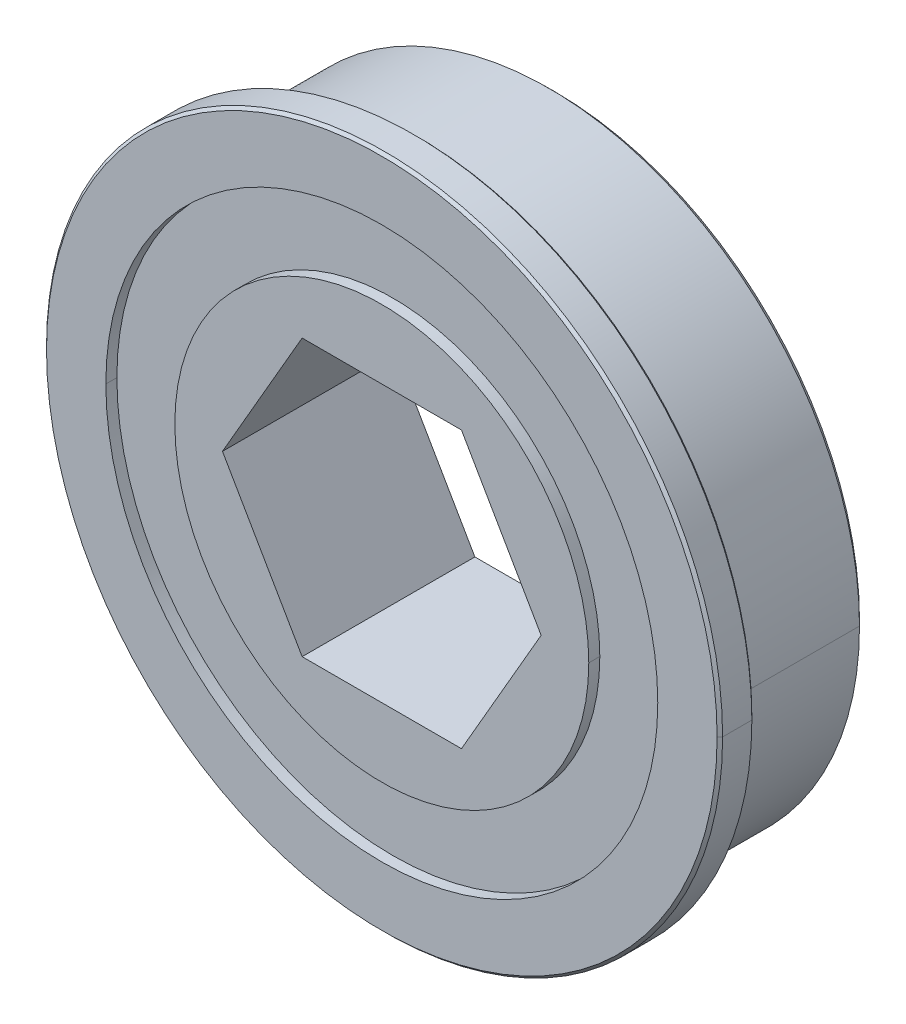
ISO-10303-21;
HEADER;
FILE_DESCRIPTION(('STEP AP214'),'2;1');
FILE_NAME('part.step','',(''),(''),'','','');
FILE_SCHEMA(('AUTOMOTIVE_DESIGN { 1 0 10303 214 1 1 1 1 }'));
ENDSEC;
DATA;
#1=APPLICATION_CONTEXT('core data for automotive mechanical design processes');
#2=APPLICATION_PROTOCOL_DEFINITION('international standard','automotive_design',2000,#1);
#3=PRODUCT_CONTEXT('',#1,'mechanical');
#4=PRODUCT('Part','Part','',(#3));
#5=PRODUCT_RELATED_PRODUCT_CATEGORY('part','',(#4));
#6=PRODUCT_DEFINITION_FORMATION('','',#4);
#7=PRODUCT_DEFINITION_CONTEXT('part definition',#1,'design');
#8=PRODUCT_DEFINITION('design','',#6,#7);
#9=PRODUCT_DEFINITION_SHAPE('','',#8);
#10=(LENGTH_UNIT() NAMED_UNIT(*) SI_UNIT(.MILLI.,.METRE.));
#11=(NAMED_UNIT(*) PLANE_ANGLE_UNIT() SI_UNIT($,.RADIAN.));
#12=(NAMED_UNIT(*) SI_UNIT($,.STERADIAN.) SOLID_ANGLE_UNIT());
#13=UNCERTAINTY_MEASURE_WITH_UNIT(LENGTH_MEASURE(1.E-05),#10,'distance_accuracy_value','');
#14=(GEOMETRIC_REPRESENTATION_CONTEXT(3) GLOBAL_UNCERTAINTY_ASSIGNED_CONTEXT((#13)) GLOBAL_UNIT_ASSIGNED_CONTEXT((#10,
#11,#12)) REPRESENTATION_CONTEXT('',''));
#15=CARTESIAN_POINT('',(0.,0.,0.));
#16=DIRECTION('',(0.,0.,1.));
#17=DIRECTION('',(1.,0.,0.));
#18=AXIS2_PLACEMENT_3D('',#15,#16,#17);
#19=CARTESIAN_POINT('',(7.33234841870825,0.,-3.975));
#20=DIRECTION('',(0.866025403784439,0.5,0.));
#21=DIRECTION('',(0.,0.,-1.));
#22=AXIS2_PLACEMENT_3D('',#19,#20,#21);
#23=PLANE('',#22);
#24=DIRECTION('',(-0.5,0.866025403784439,0.));
#25=VECTOR('',#24,1.);
#26=CARTESIAN_POINT('',(7.33234841870825,0.,3.975));
#27=LINE('',#26,#25);
#28=CARTESIAN_POINT('',(7.33234841870825,0.,3.975));
#29=VERTEX_POINT('',#28);
#30=CARTESIAN_POINT('',(3.66617420935412,6.35,3.975));
#31=VERTEX_POINT('',#30);
#32=EDGE_CURVE('E402',#29,#31,#27,.T.);
#33=ORIENTED_EDGE('',*,*,#32,.T.);
#34=DIRECTION('',(0.,0.,1.));
#35=VECTOR('',#34,1.);
#36=CARTESIAN_POINT('',(3.66617420935412,6.35,-3.975));
#37=LINE('',#36,#35);
#38=CARTESIAN_POINT('',(3.66617420935412,6.35,-3.975));
#39=VERTEX_POINT('',#38);
#40=EDGE_CURVE('E10',#39,#31,#37,.T.);
#41=ORIENTED_EDGE('',*,*,#40,.F.);
#42=DIRECTION('',(-0.5,0.866025403784439,0.));
#43=VECTOR('',#42,1.);
#44=CARTESIAN_POINT('',(7.33234841870825,0.,-3.975));
#45=LINE('',#44,#43);
#46=CARTESIAN_POINT('',(7.33234841870825,0.,-3.975));
#47=VERTEX_POINT('',#46);
#48=EDGE_CURVE('E434',#47,#39,#45,.T.);
#49=ORIENTED_EDGE('',*,*,#48,.F.);
#50=DIRECTION('',(0.,0.,1.));
#51=VECTOR('',#50,1.);
#52=CARTESIAN_POINT('',(7.33234841870825,0.,-3.975));
#53=LINE('',#52,#51);
#54=EDGE_CURVE('E354',#47,#29,#53,.T.);
#55=ORIENTED_EDGE('',*,*,#54,.T.);
#56=EDGE_LOOP('',(#33,#41,#49,#55));
#57=FACE_BOUND('',#56,.T.);
#58=ADVANCED_FACE('F16',(#57),#23,.F.);
#59=CARTESIAN_POINT('',(3.66617420935412,6.35,-3.975));
#60=DIRECTION('',(0.,1.,0.));
#61=DIRECTION('',(1.,0.,0.));
#62=AXIS2_PLACEMENT_3D('',#59,#60,#61);
#63=PLANE('',#62);
#64=DIRECTION('',(-1.,0.,0.));
#65=VECTOR('',#64,1.);
#66=CARTESIAN_POINT('',(3.66617420935412,6.35,3.975));
#67=LINE('',#66,#65);
#68=CARTESIAN_POINT('',(-3.66617420935412,6.35,3.975));
#69=VERTEX_POINT('',#68);
#70=EDGE_CURVE('E295',#31,#69,#67,.T.);
#71=ORIENTED_EDGE('',*,*,#70,.T.);
#72=DIRECTION('',(0.,0.,1.));
#73=VECTOR('',#72,1.);
#74=CARTESIAN_POINT('',(-3.66617420935412,6.35,-3.975));
#75=LINE('',#74,#73);
#76=CARTESIAN_POINT('',(-3.66617420935412,6.35,-3.975));
#77=VERTEX_POINT('',#76);
#78=EDGE_CURVE('E19',#77,#69,#75,.T.);
#79=ORIENTED_EDGE('',*,*,#78,.F.);
#80=DIRECTION('',(-1.,0.,0.));
#81=VECTOR('',#80,1.);
#82=CARTESIAN_POINT('',(3.66617420935412,6.35,-3.975));
#83=LINE('',#82,#81);
#84=EDGE_CURVE('E438',#39,#77,#83,.T.);
#85=ORIENTED_EDGE('',*,*,#84,.F.);
#86=ORIENTED_EDGE('',*,*,#40,.T.);
#87=EDGE_LOOP('',(#71,#79,#85,#86));
#88=FACE_BOUND('',#87,.T.);
#89=ADVANCED_FACE('F479',(#88),#63,.F.);
#90=CARTESIAN_POINT('',(-3.66617420935412,6.35,-3.975));
#91=DIRECTION('',(-0.866025403784439,0.5,0.));
#92=DIRECTION('',(0.,0.,1.));
#93=AXIS2_PLACEMENT_3D('',#90,#91,#92);
#94=PLANE('',#93);
#95=DIRECTION('',(-0.5,-0.866025403784439,0.));
#96=VECTOR('',#95,1.);
#97=CARTESIAN_POINT('',(-3.66617420935412,6.35,3.975));
#98=LINE('',#97,#96);
#99=CARTESIAN_POINT('',(-7.33234841870825,0.,3.975));
#100=VERTEX_POINT('',#99);
#101=EDGE_CURVE('E292',#69,#100,#98,.T.);
#102=ORIENTED_EDGE('',*,*,#101,.T.);
#103=DIRECTION('',(0.,0.,1.));
#104=VECTOR('',#103,1.);
#105=CARTESIAN_POINT('',(-7.33234841870825,0.,-3.975));
#106=LINE('',#105,#104);
#107=CARTESIAN_POINT('',(-7.33234841870825,0.,-3.975));
#108=VERTEX_POINT('',#107);
#109=EDGE_CURVE('E38',#108,#100,#106,.T.);
#110=ORIENTED_EDGE('',*,*,#109,.F.);
#111=DIRECTION('',(-0.5,-0.866025403784439,0.));
#112=VECTOR('',#111,1.);
#113=CARTESIAN_POINT('',(-3.66617420935412,6.35,-3.975));
#114=LINE('',#113,#112);
#115=EDGE_CURVE('E439',#77,#108,#114,.T.);
#116=ORIENTED_EDGE('',*,*,#115,.F.);
#117=ORIENTED_EDGE('',*,*,#78,.T.);
#118=EDGE_LOOP('',(#102,#110,#116,#117));
#119=FACE_BOUND('',#118,.T.);
#120=ADVANCED_FACE('F474',(#119),#94,.F.);
#121=CARTESIAN_POINT('',(-7.33234841870825,0.,-3.975));
#122=DIRECTION('',(-0.866025403784439,-0.5,0.));
#123=DIRECTION('',(-0.5,0.866025403784439,0.));
#124=AXIS2_PLACEMENT_3D('',#121,#122,#123);
#125=PLANE('',#124);
#126=DIRECTION('',(0.5,-0.866025403784439,0.));
#127=VECTOR('',#126,1.);
#128=CARTESIAN_POINT('',(-7.33234841870825,0.,3.975));
#129=LINE('',#128,#127);
#130=CARTESIAN_POINT('',(-3.66617420935412,-6.35,3.975));
#131=VERTEX_POINT('',#130);
#132=EDGE_CURVE('E296',#100,#131,#129,.T.);
#133=ORIENTED_EDGE('',*,*,#132,.T.);
#134=DIRECTION('',(0.,0.,1.));
#135=VECTOR('',#134,1.);
#136=CARTESIAN_POINT('',(-3.66617420935412,-6.35,-3.975));
#137=LINE('',#136,#135);
#138=CARTESIAN_POINT('',(-3.66617420935412,-6.35,-3.975));
#139=VERTEX_POINT('',#138);
#140=EDGE_CURVE('E353',#139,#131,#137,.T.);
#141=ORIENTED_EDGE('',*,*,#140,.F.);
#142=DIRECTION('',(0.5,-0.866025403784439,0.));
#143=VECTOR('',#142,1.);
#144=CARTESIAN_POINT('',(-7.33234841870825,0.,-3.975));
#145=LINE('',#144,#143);
#146=EDGE_CURVE('E309',#108,#139,#145,.T.);
#147=ORIENTED_EDGE('',*,*,#146,.F.);
#148=ORIENTED_EDGE('',*,*,#109,.T.);
#149=EDGE_LOOP('',(#133,#141,#147,#148));
#150=FACE_BOUND('',#149,.T.);
#151=ADVANCED_FACE('F487',(#150),#125,.F.);
#152=CARTESIAN_POINT('',(-3.66617420935412,-6.35,-3.975));
#153=DIRECTION('',(0.,-1.,0.));
#154=DIRECTION('',(0.,0.,-1.));
#155=AXIS2_PLACEMENT_3D('',#152,#153,#154);
#156=PLANE('',#155);
#157=DIRECTION('',(1.,0.,0.));
#158=VECTOR('',#157,1.);
#159=CARTESIAN_POINT('',(-3.66617420935412,-6.35,3.975));
#160=LINE('',#159,#158);
#161=CARTESIAN_POINT('',(3.66617420935412,-6.35,3.975));
#162=VERTEX_POINT('',#161);
#163=EDGE_CURVE('E407',#131,#162,#160,.T.);
#164=ORIENTED_EDGE('',*,*,#163,.T.);
#165=DIRECTION('',(0.,0.,1.));
#166=VECTOR('',#165,1.);
#167=CARTESIAN_POINT('',(3.66617420935412,-6.35,-3.975));
#168=LINE('',#167,#166);
#169=CARTESIAN_POINT('',(3.66617420935412,-6.35,-3.975));
#170=VERTEX_POINT('',#169);
#171=EDGE_CURVE('E350',#170,#162,#168,.T.);
#172=ORIENTED_EDGE('',*,*,#171,.F.);
#173=DIRECTION('',(1.,0.,0.));
#174=VECTOR('',#173,1.);
#175=CARTESIAN_POINT('',(-3.66617420935412,-6.35,-3.975));
#176=LINE('',#175,#174);
#177=EDGE_CURVE('E422',#139,#170,#176,.T.);
#178=ORIENTED_EDGE('',*,*,#177,.F.);
#179=ORIENTED_EDGE('',*,*,#140,.T.);
#180=EDGE_LOOP('',(#164,#172,#178,#179));
#181=FACE_BOUND('',#180,.T.);
#182=ADVANCED_FACE('F493',(#181),#156,.F.);
#183=CARTESIAN_POINT('',(3.66617420935412,-6.35,-3.975));
#184=DIRECTION('',(0.866025403784439,-0.5,0.));
#185=DIRECTION('',(0.,0.,-1.));
#186=AXIS2_PLACEMENT_3D('',#183,#184,#185);
#187=PLANE('',#186);
#188=DIRECTION('',(0.5,0.866025403784439,0.));
#189=VECTOR('',#188,1.);
#190=CARTESIAN_POINT('',(3.66617420935412,-6.35,3.975));
#191=LINE('',#190,#189);
#192=EDGE_CURVE('E403',#162,#29,#191,.T.);
#193=ORIENTED_EDGE('',*,*,#192,.T.);
#194=ORIENTED_EDGE('',*,*,#54,.F.);
#195=DIRECTION('',(0.5,0.866025403784439,0.));
#196=VECTOR('',#195,1.);
#197=CARTESIAN_POINT('',(3.66617420935412,-6.35,-3.975));
#198=LINE('',#197,#196);
#199=EDGE_CURVE('E426',#170,#47,#198,.T.);
#200=ORIENTED_EDGE('',*,*,#199,.F.);
#201=ORIENTED_EDGE('',*,*,#171,.T.);
#202=EDGE_LOOP('',(#193,#194,#200,#201));
#203=FACE_BOUND('',#202,.T.);
#204=ADVANCED_FACE('F496',(#203),#187,.F.);
#205=CARTESIAN_POINT('',(0.,0.,3.975));
#206=DIRECTION('',(0.,0.,-1.));
#207=DIRECTION('',(-1.,0.,0.));
#208=AXIS2_PLACEMENT_3D('',#205,#206,#207);
#209=CONICAL_SURFACE('',#208,15.4305,0.785398163397469);
#210=DIRECTION('',(0.707106781186562,0.,-0.707106781186533));
#211=VECTOR('',#210,1.);
#212=CARTESIAN_POINT('',(15.4305,0.,3.975));
#213=LINE('',#212,#211);
#214=CARTESIAN_POINT('',(15.4305,0.,3.975));
#215=VERTEX_POINT('',#214);
#216=CARTESIAN_POINT('',(15.5575,0.,3.848));
#217=VERTEX_POINT('',#216);
#218=EDGE_CURVE('E509',#215,#217,#213,.T.);
#219=ORIENTED_EDGE('',*,*,#218,.F.);
#220=CARTESIAN_POINT('',(0.,0.,3.975));
#221=DIRECTION('',(0.,0.,1.));
#222=DIRECTION('',(-1.,0.,0.));
#223=AXIS2_PLACEMENT_3D('',#220,#221,#222);
#224=CIRCLE('',#223,15.4305);
#225=CARTESIAN_POINT('',(-15.4305,0.,3.975));
#226=VERTEX_POINT('',#225);
#227=EDGE_CURVE('E448',#226,#215,#224,.T.);
#228=ORIENTED_EDGE('',*,*,#227,.F.);
#229=DIRECTION('',(-0.707106781186562,0.,-0.707106781186533));
#230=VECTOR('',#229,1.);
#231=CARTESIAN_POINT('',(-15.4305,0.,3.975));
#232=LINE('',#231,#230);
#233=CARTESIAN_POINT('',(-15.5575,0.,3.848));
#234=VERTEX_POINT('',#233);
#235=EDGE_CURVE('E250',#226,#234,#232,.T.);
#236=ORIENTED_EDGE('',*,*,#235,.T.);
#237=CARTESIAN_POINT('',(0.,0.,3.848));
#238=DIRECTION('',(0.,0.,-1.));
#239=DIRECTION('',(-1.,0.,0.));
#240=AXIS2_PLACEMENT_3D('',#237,#238,#239);
#241=CIRCLE('',#240,15.5575);
#242=EDGE_CURVE('E308',#217,#234,#241,.T.);
#243=ORIENTED_EDGE('',*,*,#242,.F.);
#244=EDGE_LOOP('',(#219,#228,#236,#243));
#245=FACE_BOUND('',#244,.T.);
#246=ADVANCED_FACE('F562',(#245),#209,.T.);
#247=CARTESIAN_POINT('',(0.,0.,2.502));
#248=DIRECTION('',(0.,0.,1.));
#249=DIRECTION('',(1.,0.,0.));
#250=AXIS2_PLACEMENT_3D('',#247,#248,#249);
#251=CONICAL_SURFACE('',#250,15.5575,0.785398163397442);
#252=DIRECTION('',(-0.707106781186543,0.,0.707106781186552));
#253=VECTOR('',#252,1.);
#254=CARTESIAN_POINT('',(-15.5575,0.,2.502));
#255=LINE('',#254,#253);
#256=CARTESIAN_POINT('',(-15.4305,0.,2.375));
#257=VERTEX_POINT('',#256);
#258=CARTESIAN_POINT('',(-15.5575,0.,2.502));
#259=VERTEX_POINT('',#258);
#260=EDGE_CURVE('E232',#257,#259,#255,.T.);
#261=ORIENTED_EDGE('',*,*,#260,.F.);
#262=CARTESIAN_POINT('',(0.,0.,2.375));
#263=DIRECTION('',(0.,0.,-1.));
#264=DIRECTION('',(1.,0.,0.));
#265=AXIS2_PLACEMENT_3D('',#262,#263,#264);
#266=CIRCLE('',#265,15.4305);
#267=CARTESIAN_POINT('',(15.4305,0.,2.375));
#268=VERTEX_POINT('',#267);
#269=EDGE_CURVE('E226',#268,#257,#266,.T.);
#270=ORIENTED_EDGE('',*,*,#269,.F.);
#271=DIRECTION('',(0.707106781186543,0.,0.707106781186552));
#272=VECTOR('',#271,1.);
#273=CARTESIAN_POINT('',(15.5575,0.,2.502));
#274=LINE('',#273,#272);
#275=CARTESIAN_POINT('',(15.5575,0.,2.502));
#276=VERTEX_POINT('',#275);
#277=EDGE_CURVE('E229',#268,#276,#274,.T.);
#278=ORIENTED_EDGE('',*,*,#277,.T.);
#279=CARTESIAN_POINT('',(0.,0.,2.502));
#280=DIRECTION('',(0.,0.,1.));
#281=DIRECTION('',(1.,0.,0.));
#282=AXIS2_PLACEMENT_3D('',#279,#280,#281);
#283=CIRCLE('',#282,15.5575);
#284=EDGE_CURVE('E305',#259,#276,#283,.T.);
#285=ORIENTED_EDGE('',*,*,#284,.F.);
#286=EDGE_LOOP('',(#261,#270,#278,#285));
#287=FACE_BOUND('',#286,.T.);
#288=ADVANCED_FACE('F228',(#287),#251,.T.);
#289=CARTESIAN_POINT('',(0.,0.,-3.721));
#290=DIRECTION('',(0.,0.,1.));
#291=DIRECTION('',(1.,0.,0.));
#292=AXIS2_PLACEMENT_3D('',#289,#290,#291);
#293=CONICAL_SURFACE('',#292,14.2875,0.785398163397445);
#294=DIRECTION('',(-0.707106781186545,0.,0.70710678118655));
#295=VECTOR('',#294,1.);
#296=CARTESIAN_POINT('',(-14.2875,0.,-3.721));
#297=LINE('',#296,#295);
#298=CARTESIAN_POINT('',(-14.0335,0.,-3.975));
#299=VERTEX_POINT('',#298);
#300=CARTESIAN_POINT('',(-14.2875,0.,-3.721));
#301=VERTEX_POINT('',#300);
#302=EDGE_CURVE('E272',#299,#301,#297,.T.);
#303=ORIENTED_EDGE('',*,*,#302,.F.);
#304=CARTESIAN_POINT('',(0.,0.,-3.975));
#305=DIRECTION('',(0.,0.,-1.));
#306=DIRECTION('',(1.,0.,0.));
#307=AXIS2_PLACEMENT_3D('',#304,#305,#306);
#308=CIRCLE('',#307,14.0335);
#309=CARTESIAN_POINT('',(14.0335,0.,-3.975));
#310=VERTEX_POINT('',#309);
#311=EDGE_CURVE('E281',#310,#299,#308,.T.);
#312=ORIENTED_EDGE('',*,*,#311,.F.);
#313=DIRECTION('',(0.707106781186545,0.,0.70710678118655));
#314=VECTOR('',#313,1.);
#315=CARTESIAN_POINT('',(14.2875,0.,-3.721));
#316=LINE('',#315,#314);
#317=CARTESIAN_POINT('',(14.2875,0.,-3.721));
#318=VERTEX_POINT('',#317);
#319=EDGE_CURVE('E297',#310,#318,#316,.T.);
#320=ORIENTED_EDGE('',*,*,#319,.T.);
#321=CARTESIAN_POINT('',(0.,0.,-3.721));
#322=DIRECTION('',(0.,0.,1.));
#323=DIRECTION('',(1.,0.,0.));
#324=AXIS2_PLACEMENT_3D('',#321,#322,#323);
#325=CIRCLE('',#324,14.2875);
#326=EDGE_CURVE('E280',#301,#318,#325,.T.);
#327=ORIENTED_EDGE('',*,*,#326,.F.);
#328=EDGE_LOOP('',(#303,#312,#320,#327));
#329=FACE_BOUND('',#328,.T.);
#330=ADVANCED_FACE('F561',(#329),#293,.T.);
#331=CARTESIAN_POINT('',(0.,0.,3.467));
#332=DIRECTION('',(0.,0.,1.));
#333=DIRECTION('',(1.,0.,0.));
#334=AXIS2_PLACEMENT_3D('',#331,#332,#333);
#335=CYLINDRICAL_SURFACE('',#334,9.525);
#336=DIRECTION('',(0.,0.,1.));
#337=VECTOR('',#336,1.);
#338=CARTESIAN_POINT('',(-9.525,0.,3.467));
#339=LINE('',#338,#337);
#340=CARTESIAN_POINT('',(-9.525,0.,3.467));
#341=VERTEX_POINT('',#340);
#342=CARTESIAN_POINT('',(-9.525,0.,3.975));
#343=VERTEX_POINT('',#342);
#344=EDGE_CURVE('E291',#341,#343,#339,.T.);
#345=ORIENTED_EDGE('',*,*,#344,.F.);
#346=CARTESIAN_POINT('',(0.,0.,3.467));
#347=DIRECTION('',(0.,0.,-1.));
#348=DIRECTION('',(-1.,0.,0.));
#349=AXIS2_PLACEMENT_3D('',#346,#347,#348);
#350=CIRCLE('',#349,9.525);
#351=CARTESIAN_POINT('',(9.525,0.,3.467));
#352=VERTEX_POINT('',#351);
#353=EDGE_CURVE('E416',#352,#341,#350,.T.);
#354=ORIENTED_EDGE('',*,*,#353,.F.);
#355=DIRECTION('',(0.,0.,1.));
#356=VECTOR('',#355,1.);
#357=CARTESIAN_POINT('',(9.525,0.,3.467));
#358=LINE('',#357,#356);
#359=CARTESIAN_POINT('',(9.525,0.,3.975));
#360=VERTEX_POINT('',#359);
#361=EDGE_CURVE('E282',#352,#360,#358,.T.);
#362=ORIENTED_EDGE('',*,*,#361,.T.);
#363=CARTESIAN_POINT('',(0.,0.,3.975));
#364=DIRECTION('',(0.,0.,-1.));
#365=DIRECTION('',(-1.,0.,0.));
#366=AXIS2_PLACEMENT_3D('',#363,#364,#365);
#367=CIRCLE('',#366,9.525);
#368=EDGE_CURVE('E380',#360,#343,#367,.T.);
#369=ORIENTED_EDGE('',*,*,#368,.T.);
#370=EDGE_LOOP('',(#345,#354,#362,#369));
#371=FACE_BOUND('',#370,.T.);
#372=ADVANCED_FACE('F530',(#371),#335,.T.);
#373=CARTESIAN_POINT('',(0.,0.,3.467));
#374=DIRECTION('',(0.,0.,1.));
#375=DIRECTION('',(1.,0.,0.));
#376=AXIS2_PLACEMENT_3D('',#373,#374,#375);
#377=CYLINDRICAL_SURFACE('',#376,12.7);
#378=DIRECTION('',(0.,0.,1.));
#379=VECTOR('',#378,1.);
#380=CARTESIAN_POINT('',(-12.7,0.,3.467));
#381=LINE('',#380,#379);
#382=CARTESIAN_POINT('',(-12.7,0.,3.467));
#383=VERTEX_POINT('',#382);
#384=CARTESIAN_POINT('',(-12.7,0.,3.975));
#385=VERTEX_POINT('',#384);
#386=EDGE_CURVE('E313',#383,#385,#381,.T.);
#387=ORIENTED_EDGE('',*,*,#386,.F.);
#388=CARTESIAN_POINT('',(0.,0.,3.467));
#389=DIRECTION('',(0.,0.,-1.));
#390=DIRECTION('',(-1.,0.,0.));
#391=AXIS2_PLACEMENT_3D('',#388,#389,#390);
#392=CIRCLE('',#391,12.7);
#393=CARTESIAN_POINT('',(12.7,0.,3.467));
#394=VERTEX_POINT('',#393);
#395=EDGE_CURVE('E430',#383,#394,#392,.T.);
#396=ORIENTED_EDGE('',*,*,#395,.T.);
#397=DIRECTION('',(0.,0.,1.));
#398=VECTOR('',#397,1.);
#399=CARTESIAN_POINT('',(12.7,0.,3.467));
#400=LINE('',#399,#398);
#401=CARTESIAN_POINT('',(12.7,0.,3.975));
#402=VERTEX_POINT('',#401);
#403=EDGE_CURVE('E324',#394,#402,#400,.T.);
#404=ORIENTED_EDGE('',*,*,#403,.T.);
#405=CARTESIAN_POINT('',(0.,0.,3.975));
#406=DIRECTION('',(0.,0.,-1.));
#407=DIRECTION('',(-1.,0.,0.));
#408=AXIS2_PLACEMENT_3D('',#405,#406,#407);
#409=CIRCLE('',#408,12.7);
#410=EDGE_CURVE('E316',#385,#402,#409,.T.);
#411=ORIENTED_EDGE('',*,*,#410,.F.);
#412=EDGE_LOOP('',(#387,#396,#404,#411));
#413=FACE_BOUND('',#412,.T.);
#414=ADVANCED_FACE('F568',(#413),#377,.F.);
#415=CARTESIAN_POINT('',(0.,0.,3.467));
#416=DIRECTION('',(0.,0.,1.));
#417=DIRECTION('',(1.,0.,0.));
#418=AXIS2_PLACEMENT_3D('',#415,#416,#417);
#419=PLANE('',#418);
#420=ORIENTED_EDGE('',*,*,#353,.T.);
#421=CARTESIAN_POINT('',(0.,0.,3.467));
#422=DIRECTION('',(0.,0.,-1.));
#423=DIRECTION('',(-1.,0.,0.));
#424=AXIS2_PLACEMENT_3D('',#421,#422,#423);
#425=CIRCLE('',#424,9.525);
#426=EDGE_CURVE('E301',#341,#352,#425,.T.);
#427=ORIENTED_EDGE('',*,*,#426,.T.);
#428=EDGE_LOOP('',(#420,#427));
#429=FACE_BOUND('',#428,.T.);
#430=CARTESIAN_POINT('',(0.,0.,3.467));
#431=DIRECTION('',(0.,0.,-1.));
#432=DIRECTION('',(-1.,0.,0.));
#433=AXIS2_PLACEMENT_3D('',#430,#431,#432);
#434=CIRCLE('',#433,12.7);
#435=EDGE_CURVE('E286',#394,#383,#434,.T.);
#436=ORIENTED_EDGE('',*,*,#435,.F.);
#437=ORIENTED_EDGE('',*,*,#395,.F.);
#438=EDGE_LOOP('',(#436,#437));
#439=FACE_BOUND('',#438,.T.);
#440=ADVANCED_FACE('F522',(#429,#439),#419,.T.);
#441=CARTESIAN_POINT('',(0.,0.,-3.467));
#442=DIRECTION('',(0.,0.,-1.));
#443=DIRECTION('',(-1.,0.,0.));
#444=AXIS2_PLACEMENT_3D('',#441,#442,#443);
#445=CYLINDRICAL_SURFACE('',#444,9.525);
#446=DIRECTION('',(0.,0.,-1.));
#447=VECTOR('',#446,1.);
#448=CARTESIAN_POINT('',(9.525,0.,-3.467));
#449=LINE('',#448,#447);
#450=CARTESIAN_POINT('',(9.525,0.,-3.467));
#451=VERTEX_POINT('',#450);
#452=CARTESIAN_POINT('',(9.525,0.,-3.975));
#453=VERTEX_POINT('',#452);
#454=EDGE_CURVE('E337',#451,#453,#449,.T.);
#455=ORIENTED_EDGE('',*,*,#454,.F.);
#456=CARTESIAN_POINT('',(0.,0.,-3.467));
#457=DIRECTION('',(0.,0.,-1.));
#458=DIRECTION('',(-1.,0.,0.));
#459=AXIS2_PLACEMENT_3D('',#456,#457,#458);
#460=CIRCLE('',#459,9.525);
#461=CARTESIAN_POINT('',(-9.525,0.,-3.467));
#462=VERTEX_POINT('',#461);
#463=EDGE_CURVE('E427',#451,#462,#460,.T.);
#464=ORIENTED_EDGE('',*,*,#463,.T.);
#465=DIRECTION('',(0.,0.,-1.));
#466=VECTOR('',#465,1.);
#467=CARTESIAN_POINT('',(-9.525,0.,-3.467));
#468=LINE('',#467,#466);
#469=CARTESIAN_POINT('',(-9.525,0.,-3.975));
#470=VERTEX_POINT('',#469);
#471=EDGE_CURVE('E349',#462,#470,#468,.T.);
#472=ORIENTED_EDGE('',*,*,#471,.T.);
#473=CARTESIAN_POINT('',(0.,0.,-3.975));
#474=DIRECTION('',(0.,0.,-1.));
#475=DIRECTION('',(-1.,0.,0.));
#476=AXIS2_PLACEMENT_3D('',#473,#474,#475);
#477=CIRCLE('',#476,9.525);
#478=EDGE_CURVE('E419',#453,#470,#477,.T.);
#479=ORIENTED_EDGE('',*,*,#478,.F.);
#480=EDGE_LOOP('',(#455,#464,#472,#479));
#481=FACE_BOUND('',#480,.T.);
#482=ADVANCED_FACE('F574',(#481),#445,.T.);
#483=CARTESIAN_POINT('',(0.,0.,-3.467));
#484=DIRECTION('',(0.,0.,-1.));
#485=DIRECTION('',(0.,-1.,0.));
#486=AXIS2_PLACEMENT_3D('',#483,#484,#485);
#487=PLANE('',#486);
#488=CARTESIAN_POINT('',(0.,0.,-3.467));
#489=DIRECTION('',(0.,0.,-1.));
#490=DIRECTION('',(-1.,0.,0.));
#491=AXIS2_PLACEMENT_3D('',#488,#489,#490);
#492=CIRCLE('',#491,9.525);
#493=EDGE_CURVE('E328',#462,#451,#492,.T.);
#494=ORIENTED_EDGE('',*,*,#493,.F.);
#495=ORIENTED_EDGE('',*,*,#463,.F.);
#496=EDGE_LOOP('',(#494,#495));
#497=FACE_BOUND('',#496,.T.);
#498=CARTESIAN_POINT('',(0.,0.,-3.467));
#499=DIRECTION('',(0.,0.,-1.));
#500=DIRECTION('',(-1.,0.,0.));
#501=AXIS2_PLACEMENT_3D('',#498,#499,#500);
#502=CIRCLE('',#501,12.7);
#503=CARTESIAN_POINT('',(-12.7,0.,-3.467));
#504=VERTEX_POINT('',#503);
#505=CARTESIAN_POINT('',(12.7,0.,-3.467));
#506=VERTEX_POINT('',#505);
#507=EDGE_CURVE('E237',#504,#506,#502,.T.);
#508=ORIENTED_EDGE('',*,*,#507,.T.);
#509=CARTESIAN_POINT('',(0.,0.,-3.467));
#510=DIRECTION('',(0.,0.,-1.));
#511=DIRECTION('',(-1.,0.,0.));
#512=AXIS2_PLACEMENT_3D('',#509,#510,#511);
#513=CIRCLE('',#512,12.7);
#514=EDGE_CURVE('E358',#506,#504,#513,.T.);
#515=ORIENTED_EDGE('',*,*,#514,.T.);
#516=EDGE_LOOP('',(#508,#515));
#517=FACE_BOUND('',#516,.T.);
#518=ADVANCED_FACE('F577',(#497,#517),#487,.T.);
#519=CARTESIAN_POINT('',(0.,0.,-3.467));
#520=DIRECTION('',(0.,0.,-1.));
#521=DIRECTION('',(-1.,0.,0.));
#522=AXIS2_PLACEMENT_3D('',#519,#520,#521);
#523=CYLINDRICAL_SURFACE('',#522,12.7);
#524=DIRECTION('',(0.,0.,-1.));
#525=VECTOR('',#524,1.);
#526=CARTESIAN_POINT('',(12.7,0.,-3.467));
#527=LINE('',#526,#525);
#528=CARTESIAN_POINT('',(12.7,0.,-3.975));
#529=VERTEX_POINT('',#528);
#530=EDGE_CURVE('E362',#506,#529,#527,.T.);
#531=ORIENTED_EDGE('',*,*,#530,.F.);
#532=ORIENTED_EDGE('',*,*,#507,.F.);
#533=DIRECTION('',(0.,0.,-1.));
#534=VECTOR('',#533,1.);
#535=CARTESIAN_POINT('',(-12.7,0.,-3.467));
#536=LINE('',#535,#534);
#537=CARTESIAN_POINT('',(-12.7,0.,-3.975));
#538=VERTEX_POINT('',#537);
#539=EDGE_CURVE('E262',#504,#538,#536,.T.);
#540=ORIENTED_EDGE('',*,*,#539,.T.);
#541=CARTESIAN_POINT('',(0.,0.,-3.975));
#542=DIRECTION('',(0.,0.,-1.));
#543=DIRECTION('',(-1.,0.,0.));
#544=AXIS2_PLACEMENT_3D('',#541,#542,#543);
#545=CIRCLE('',#544,12.7);
#546=EDGE_CURVE('E277',#538,#529,#545,.T.);
#547=ORIENTED_EDGE('',*,*,#546,.T.);
#548=EDGE_LOOP('',(#531,#532,#540,#547));
#549=FACE_BOUND('',#548,.T.);
#550=ADVANCED_FACE('F581',(#549),#523,.F.);
#551=CARTESIAN_POINT('',(0.,14.2875,2.375));
#552=DIRECTION('',(0.,0.,1.));
#553=DIRECTION('',(1.,0.,0.));
#554=AXIS2_PLACEMENT_3D('',#551,#552,#553);
#555=PLANE('',#554);
#556=CARTESIAN_POINT('',(0.,0.,2.375));
#557=DIRECTION('',(0.,0.,1.));
#558=DIRECTION('',(1.,0.,0.));
#559=AXIS2_PLACEMENT_3D('',#556,#557,#558);
#560=CIRCLE('',#559,14.1605);
#561=CARTESIAN_POINT('',(14.1605,0.,2.375));
#562=VERTEX_POINT('',#561);
#563=CARTESIAN_POINT('',(-14.1605,0.,2.375));
#564=VERTEX_POINT('',#563);
#565=EDGE_CURVE('E333',#562,#564,#560,.T.);
#566=ORIENTED_EDGE('',*,*,#565,.T.);
#567=CARTESIAN_POINT('',(0.,0.,2.375));
#568=DIRECTION('',(0.,0.,1.));
#569=DIRECTION('',(1.,0.,0.));
#570=AXIS2_PLACEMENT_3D('',#567,#568,#569);
#571=CIRCLE('',#570,14.1605);
#572=EDGE_CURVE('E238',#564,#562,#571,.T.);
#573=ORIENTED_EDGE('',*,*,#572,.T.);
#574=EDGE_LOOP('',(#566,#573));
#575=FACE_BOUND('',#574,.T.);
#576=ORIENTED_EDGE('',*,*,#269,.T.);
#577=CARTESIAN_POINT('',(0.,0.,2.375));
#578=DIRECTION('',(0.,0.,-1.));
#579=DIRECTION('',(1.,0.,0.));
#580=AXIS2_PLACEMENT_3D('',#577,#578,#579);
#581=CIRCLE('',#580,15.4305);
#582=EDGE_CURVE('E242',#257,#268,#581,.T.);
#583=ORIENTED_EDGE('',*,*,#582,.T.);
#584=EDGE_LOOP('',(#576,#583));
#585=FACE_BOUND('',#584,.T.);
#586=ADVANCED_FACE('F248',(#575,#585),#555,.F.);
#587=CARTESIAN_POINT('',(0.,0.,6.18055555555556));
#588=DIRECTION('',(0.,0.,1.));
#589=DIRECTION('',(1.,0.,0.));
#590=AXIS2_PLACEMENT_3D('',#587,#588,#589);
#591=CYLINDRICAL_SURFACE('',#590,14.1605);
#592=DIRECTION('',(0.,0.,1.));
#593=VECTOR('',#592,1.);
#594=CARTESIAN_POINT('',(-14.1605,0.,6.18055555555556));
#595=LINE('',#594,#593);
#596=CARTESIAN_POINT('',(-14.1605,0.,2.121));
#597=VERTEX_POINT('',#596);
#598=EDGE_CURVE('E329',#597,#564,#595,.T.);
#599=ORIENTED_EDGE('',*,*,#598,.F.);
#600=CARTESIAN_POINT('',(0.,0.,2.121));
#601=DIRECTION('',(0.,0.,1.));
#602=DIRECTION('',(1.,0.,0.));
#603=AXIS2_PLACEMENT_3D('',#600,#601,#602);
#604=CIRCLE('',#603,14.1605);
#605=CARTESIAN_POINT('',(14.1605,0.,2.121));
#606=VERTEX_POINT('',#605);
#607=EDGE_CURVE('E338',#597,#606,#604,.T.);
#608=ORIENTED_EDGE('',*,*,#607,.T.);
#609=DIRECTION('',(0.,0.,1.));
#610=VECTOR('',#609,1.);
#611=CARTESIAN_POINT('',(14.1605,0.,6.18055555555556));
#612=LINE('',#611,#610);
#613=EDGE_CURVE('E375',#606,#562,#612,.T.);
#614=ORIENTED_EDGE('',*,*,#613,.T.);
#615=ORIENTED_EDGE('',*,*,#572,.F.);
#616=EDGE_LOOP('',(#599,#608,#614,#615));
#617=FACE_BOUND('',#616,.T.);
#618=ADVANCED_FACE('F588',(#617),#591,.T.);
#619=CARTESIAN_POINT('',(0.,14.1605,2.121));
#620=DIRECTION('',(0.,0.,-1.));
#621=DIRECTION('',(0.,-1.,0.));
#622=AXIS2_PLACEMENT_3D('',#619,#620,#621);
#623=PLANE('',#622);
#624=CARTESIAN_POINT('',(0.,0.,2.121));
#625=DIRECTION('',(0.,0.,1.));
#626=DIRECTION('',(1.,0.,0.));
#627=AXIS2_PLACEMENT_3D('',#624,#625,#626);
#628=CIRCLE('',#627,14.1605);
#629=EDGE_CURVE('E265',#606,#597,#628,.T.);
#630=ORIENTED_EDGE('',*,*,#629,.F.);
#631=ORIENTED_EDGE('',*,*,#607,.F.);
#632=EDGE_LOOP('',(#630,#631));
#633=FACE_BOUND('',#632,.T.);
#634=CARTESIAN_POINT('',(0.,0.,2.121));
#635=DIRECTION('',(0.,0.,1.));
#636=DIRECTION('',(1.,0.,0.));
#637=AXIS2_PLACEMENT_3D('',#634,#635,#636);
#638=CIRCLE('',#637,14.2875);
#639=CARTESIAN_POINT('',(14.2875,0.,2.121));
#640=VERTEX_POINT('',#639);
#641=CARTESIAN_POINT('',(-14.2875,0.,2.121));
#642=VERTEX_POINT('',#641);
#643=EDGE_CURVE('E389',#640,#642,#638,.T.);
#644=ORIENTED_EDGE('',*,*,#643,.T.);
#645=CARTESIAN_POINT('',(0.,0.,2.121));
#646=DIRECTION('',(0.,0.,1.));
#647=DIRECTION('',(1.,0.,0.));
#648=AXIS2_PLACEMENT_3D('',#645,#646,#647);
#649=CIRCLE('',#648,14.2875);
#650=EDGE_CURVE('E341',#642,#640,#649,.T.);
#651=ORIENTED_EDGE('',*,*,#650,.T.);
#652=EDGE_LOOP('',(#644,#651));
#653=FACE_BOUND('',#652,.T.);
#654=ADVANCED_FACE('F592',(#633,#653),#623,.F.);
#655=CARTESIAN_POINT('',(0.,0.,6.18055555555556));
#656=DIRECTION('',(0.,0.,1.));
#657=DIRECTION('',(1.,0.,0.));
#658=AXIS2_PLACEMENT_3D('',#655,#656,#657);
#659=CYLINDRICAL_SURFACE('',#658,14.2875);
#660=DIRECTION('',(0.,0.,1.));
#661=VECTOR('',#660,1.);
#662=CARTESIAN_POINT('',(-14.2875,0.,6.18055555555556));
#663=LINE('',#662,#661);
#664=EDGE_CURVE('E385',#301,#642,#663,.T.);
#665=ORIENTED_EDGE('',*,*,#664,.F.);
#666=ORIENTED_EDGE('',*,*,#326,.T.);
#667=DIRECTION('',(0.,0.,1.));
#668=VECTOR('',#667,1.);
#669=CARTESIAN_POINT('',(14.2875,0.,6.18055555555556));
#670=LINE('',#669,#668);
#671=EDGE_CURVE('E393',#318,#640,#670,.T.);
#672=ORIENTED_EDGE('',*,*,#671,.T.);
#673=ORIENTED_EDGE('',*,*,#650,.F.);
#674=EDGE_LOOP('',(#665,#666,#672,#673));
#675=FACE_BOUND('',#674,.T.);
#676=ADVANCED_FACE('F596',(#675),#659,.T.);
#677=CARTESIAN_POINT('',(0.,5.08,-3.975));
#678=DIRECTION('',(0.,0.,1.));
#679=DIRECTION('',(1.,0.,0.));
#680=AXIS2_PLACEMENT_3D('',#677,#678,#679);
#681=PLANE('',#680);
#682=ORIENTED_EDGE('',*,*,#546,.F.);
#683=CARTESIAN_POINT('',(0.,0.,-3.975));
#684=DIRECTION('',(0.,0.,-1.));
#685=DIRECTION('',(-1.,0.,0.));
#686=AXIS2_PLACEMENT_3D('',#683,#684,#685);
#687=CIRCLE('',#686,12.7);
#688=EDGE_CURVE('E266',#529,#538,#687,.T.);
#689=ORIENTED_EDGE('',*,*,#688,.F.);
#690=EDGE_LOOP('',(#682,#689));
#691=FACE_BOUND('',#690,.T.);
#692=ORIENTED_EDGE('',*,*,#311,.T.);
#693=CARTESIAN_POINT('',(0.,0.,-3.975));
#694=DIRECTION('',(0.,0.,-1.));
#695=DIRECTION('',(1.,0.,0.));
#696=AXIS2_PLACEMENT_3D('',#693,#694,#695);
#697=CIRCLE('',#696,14.0335);
#698=EDGE_CURVE('E246',#299,#310,#697,.T.);
#699=ORIENTED_EDGE('',*,*,#698,.T.);
#700=EDGE_LOOP('',(#692,#699));
#701=FACE_BOUND('',#700,.T.);
#702=ADVANCED_FACE('F600',(#691,#701),#681,.F.);
#703=CARTESIAN_POINT('',(0.,15.5575,3.975));
#704=DIRECTION('',(0.,0.,-1.));
#705=DIRECTION('',(0.,-1.,0.));
#706=AXIS2_PLACEMENT_3D('',#703,#704,#705);
#707=PLANE('',#706);
#708=CARTESIAN_POINT('',(0.,0.,3.975));
#709=DIRECTION('',(0.,0.,-1.));
#710=DIRECTION('',(-1.,0.,0.));
#711=AXIS2_PLACEMENT_3D('',#708,#709,#710);
#712=CIRCLE('',#711,12.7);
#713=EDGE_CURVE('E320',#402,#385,#712,.T.);
#714=ORIENTED_EDGE('',*,*,#713,.T.);
#715=ORIENTED_EDGE('',*,*,#410,.T.);
#716=EDGE_LOOP('',(#714,#715));
#717=FACE_BOUND('',#716,.T.);
#718=ORIENTED_EDGE('',*,*,#227,.T.);
#719=CARTESIAN_POINT('',(0.,0.,3.975));
#720=DIRECTION('',(0.,0.,1.));
#721=DIRECTION('',(-1.,0.,0.));
#722=AXIS2_PLACEMENT_3D('',#719,#720,#721);
#723=CIRCLE('',#722,15.4305);
#724=EDGE_CURVE('E513',#215,#226,#723,.T.);
#725=ORIENTED_EDGE('',*,*,#724,.T.);
#726=EDGE_LOOP('',(#718,#725));
#727=FACE_BOUND('',#726,.T.);
#728=ADVANCED_FACE('F605',(#717,#727),#707,.F.);
#729=CARTESIAN_POINT('',(0.,0.,6.18055555555556));
#730=DIRECTION('',(0.,0.,1.));
#731=DIRECTION('',(1.,0.,0.));
#732=AXIS2_PLACEMENT_3D('',#729,#730,#731);
#733=CYLINDRICAL_SURFACE('',#732,15.5575);
#734=DIRECTION('',(0.,0.,1.));
#735=VECTOR('',#734,1.);
#736=CARTESIAN_POINT('',(-15.5575,0.,6.18055555555556));
#737=LINE('',#736,#735);
#738=EDGE_CURVE('E381',#259,#234,#737,.T.);
#739=ORIENTED_EDGE('',*,*,#738,.F.);
#740=ORIENTED_EDGE('',*,*,#284,.T.);
#741=DIRECTION('',(0.,0.,1.));
#742=VECTOR('',#741,1.);
#743=CARTESIAN_POINT('',(15.5575,0.,6.18055555555556));
#744=LINE('',#743,#742);
#745=EDGE_CURVE('E376',#276,#217,#744,.T.);
#746=ORIENTED_EDGE('',*,*,#745,.T.);
#747=ORIENTED_EDGE('',*,*,#242,.T.);
#748=EDGE_LOOP('',(#739,#740,#746,#747));
#749=FACE_BOUND('',#748,.T.);
#750=ADVANCED_FACE('F542',(#749),#733,.T.);
#751=CARTESIAN_POINT('',(0.,5.08,-3.975));
#752=DIRECTION('',(0.,0.,1.));
#753=DIRECTION('',(1.,0.,0.));
#754=AXIS2_PLACEMENT_3D('',#751,#752,#753);
#755=PLANE('',#754);
#756=ORIENTED_EDGE('',*,*,#177,.T.);
#757=ORIENTED_EDGE('',*,*,#199,.T.);
#758=ORIENTED_EDGE('',*,*,#48,.T.);
#759=ORIENTED_EDGE('',*,*,#84,.T.);
#760=ORIENTED_EDGE('',*,*,#115,.T.);
#761=ORIENTED_EDGE('',*,*,#146,.T.);
#762=EDGE_LOOP('',(#756,#757,#758,#759,#760,#761));
#763=FACE_BOUND('',#762,.T.);
#764=CARTESIAN_POINT('',(0.,0.,-3.975));
#765=DIRECTION('',(0.,0.,-1.));
#766=DIRECTION('',(-1.,0.,0.));
#767=AXIS2_PLACEMENT_3D('',#764,#765,#766);
#768=CIRCLE('',#767,9.525);
#769=EDGE_CURVE('E345',#470,#453,#768,.T.);
#770=ORIENTED_EDGE('',*,*,#769,.T.);
#771=ORIENTED_EDGE('',*,*,#478,.T.);
#772=EDGE_LOOP('',(#770,#771));
#773=FACE_BOUND('',#772,.T.);
#774=ADVANCED_FACE('F491',(#763,#773),#755,.F.);
#775=CARTESIAN_POINT('',(0.,15.5575,3.975));
#776=DIRECTION('',(0.,0.,-1.));
#777=DIRECTION('',(0.,-1.,0.));
#778=AXIS2_PLACEMENT_3D('',#775,#776,#777);
#779=PLANE('',#778);
#780=ORIENTED_EDGE('',*,*,#32,.F.);
#781=ORIENTED_EDGE('',*,*,#192,.F.);
#782=ORIENTED_EDGE('',*,*,#163,.F.);
#783=ORIENTED_EDGE('',*,*,#132,.F.);
#784=ORIENTED_EDGE('',*,*,#101,.F.);
#785=ORIENTED_EDGE('',*,*,#70,.F.);
#786=EDGE_LOOP('',(#780,#781,#782,#783,#784,#785));
#787=FACE_BOUND('',#786,.T.);
#788=ORIENTED_EDGE('',*,*,#368,.F.);
#789=CARTESIAN_POINT('',(0.,0.,3.975));
#790=DIRECTION('',(0.,0.,-1.));
#791=DIRECTION('',(-1.,0.,0.));
#792=AXIS2_PLACEMENT_3D('',#789,#790,#791);
#793=CIRCLE('',#792,9.525);
#794=EDGE_CURVE('E287',#343,#360,#793,.T.);
#795=ORIENTED_EDGE('',*,*,#794,.F.);
#796=EDGE_LOOP('',(#788,#795));
#797=FACE_BOUND('',#796,.T.);
#798=ADVANCED_FACE('F483',(#787,#797),#779,.F.);
#799=CARTESIAN_POINT('',(0.,0.,6.18055555555556));
#800=DIRECTION('',(0.,0.,1.));
#801=DIRECTION('',(1.,0.,0.));
#802=AXIS2_PLACEMENT_3D('',#799,#800,#801);
#803=CYLINDRICAL_SURFACE('',#802,15.5575);
#804=CARTESIAN_POINT('',(0.,0.,2.502));
#805=DIRECTION('',(0.,0.,1.));
#806=DIRECTION('',(1.,0.,0.));
#807=AXIS2_PLACEMENT_3D('',#804,#805,#806);
#808=CIRCLE('',#807,15.5575);
#809=EDGE_CURVE('E244',#276,#259,#808,.T.);
#810=ORIENTED_EDGE('',*,*,#809,.T.);
#811=ORIENTED_EDGE('',*,*,#738,.T.);
#812=CARTESIAN_POINT('',(0.,0.,3.848));
#813=DIRECTION('',(0.,0.,-1.));
#814=DIRECTION('',(-1.,0.,0.));
#815=AXIS2_PLACEMENT_3D('',#812,#813,#814);
#816=CIRCLE('',#815,15.5575);
#817=EDGE_CURVE('E259',#234,#217,#816,.T.);
#818=ORIENTED_EDGE('',*,*,#817,.T.);
#819=ORIENTED_EDGE('',*,*,#745,.F.);
#820=EDGE_LOOP('',(#810,#811,#818,#819));
#821=FACE_BOUND('',#820,.T.);
#822=ADVANCED_FACE('F532',(#821),#803,.T.);
#823=CARTESIAN_POINT('',(0.,0.,6.18055555555556));
#824=DIRECTION('',(0.,0.,1.));
#825=DIRECTION('',(1.,0.,0.));
#826=AXIS2_PLACEMENT_3D('',#823,#824,#825);
#827=CYLINDRICAL_SURFACE('',#826,14.2875);
#828=CARTESIAN_POINT('',(0.,0.,-3.721));
#829=DIRECTION('',(0.,0.,1.));
#830=DIRECTION('',(1.,0.,0.));
#831=AXIS2_PLACEMENT_3D('',#828,#829,#830);
#832=CIRCLE('',#831,14.2875);
#833=EDGE_CURVE('E276',#318,#301,#832,.T.);
#834=ORIENTED_EDGE('',*,*,#833,.T.);
#835=ORIENTED_EDGE('',*,*,#664,.T.);
#836=ORIENTED_EDGE('',*,*,#643,.F.);
#837=ORIENTED_EDGE('',*,*,#671,.F.);
#838=EDGE_LOOP('',(#834,#835,#836,#837));
#839=FACE_BOUND('',#838,.T.);
#840=ADVANCED_FACE('F539',(#839),#827,.T.);
#841=CARTESIAN_POINT('',(0.,0.,6.18055555555556));
#842=DIRECTION('',(0.,0.,1.));
#843=DIRECTION('',(1.,0.,0.));
#844=AXIS2_PLACEMENT_3D('',#841,#842,#843);
#845=CYLINDRICAL_SURFACE('',#844,14.1605);
#846=ORIENTED_EDGE('',*,*,#629,.T.);
#847=ORIENTED_EDGE('',*,*,#598,.T.);
#848=ORIENTED_EDGE('',*,*,#565,.F.);
#849=ORIENTED_EDGE('',*,*,#613,.F.);
#850=EDGE_LOOP('',(#846,#847,#848,#849));
#851=FACE_BOUND('',#850,.T.);
#852=ADVANCED_FACE('F909',(#851),#845,.T.);
#853=CARTESIAN_POINT('',(0.,0.,-3.467));
#854=DIRECTION('',(0.,0.,-1.));
#855=DIRECTION('',(-1.,0.,0.));
#856=AXIS2_PLACEMENT_3D('',#853,#854,#855);
#857=CYLINDRICAL_SURFACE('',#856,12.7);
#858=ORIENTED_EDGE('',*,*,#514,.F.);
#859=ORIENTED_EDGE('',*,*,#530,.T.);
#860=ORIENTED_EDGE('',*,*,#688,.T.);
#861=ORIENTED_EDGE('',*,*,#539,.F.);
#862=EDGE_LOOP('',(#858,#859,#860,#861));
#863=FACE_BOUND('',#862,.T.);
#864=ADVANCED_FACE('F900',(#863),#857,.F.);
#865=CARTESIAN_POINT('',(0.,0.,-3.467));
#866=DIRECTION('',(0.,0.,-1.));
#867=DIRECTION('',(-1.,0.,0.));
#868=AXIS2_PLACEMENT_3D('',#865,#866,#867);
#869=CYLINDRICAL_SURFACE('',#868,9.525);
#870=ORIENTED_EDGE('',*,*,#493,.T.);
#871=ORIENTED_EDGE('',*,*,#454,.T.);
#872=ORIENTED_EDGE('',*,*,#769,.F.);
#873=ORIENTED_EDGE('',*,*,#471,.F.);
#874=EDGE_LOOP('',(#870,#871,#872,#873));
#875=FACE_BOUND('',#874,.T.);
#876=ADVANCED_FACE('F850',(#875),#869,.T.);
#877=CARTESIAN_POINT('',(0.,0.,3.467));
#878=DIRECTION('',(0.,0.,1.));
#879=DIRECTION('',(1.,0.,0.));
#880=AXIS2_PLACEMENT_3D('',#877,#878,#879);
#881=CYLINDRICAL_SURFACE('',#880,12.7);
#882=ORIENTED_EDGE('',*,*,#435,.T.);
#883=ORIENTED_EDGE('',*,*,#386,.T.);
#884=ORIENTED_EDGE('',*,*,#713,.F.);
#885=ORIENTED_EDGE('',*,*,#403,.F.);
#886=EDGE_LOOP('',(#882,#883,#884,#885));
#887=FACE_BOUND('',#886,.T.);
#888=ADVANCED_FACE('F846',(#887),#881,.F.);
#889=CARTESIAN_POINT('',(0.,0.,3.467));
#890=DIRECTION('',(0.,0.,1.));
#891=DIRECTION('',(1.,0.,0.));
#892=AXIS2_PLACEMENT_3D('',#889,#890,#891);
#893=CYLINDRICAL_SURFACE('',#892,9.525);
#894=ORIENTED_EDGE('',*,*,#426,.F.);
#895=ORIENTED_EDGE('',*,*,#344,.T.);
#896=ORIENTED_EDGE('',*,*,#794,.T.);
#897=ORIENTED_EDGE('',*,*,#361,.F.);
#898=EDGE_LOOP('',(#894,#895,#896,#897));
#899=FACE_BOUND('',#898,.T.);
#900=ADVANCED_FACE('F527',(#899),#893,.T.);
#901=CARTESIAN_POINT('',(0.,0.,-3.721));
#902=DIRECTION('',(0.,0.,1.));
#903=DIRECTION('',(1.,0.,0.));
#904=AXIS2_PLACEMENT_3D('',#901,#902,#903);
#905=CONICAL_SURFACE('',#904,14.2875,0.785398163397445);
#906=ORIENTED_EDGE('',*,*,#698,.F.);
#907=ORIENTED_EDGE('',*,*,#302,.T.);
#908=ORIENTED_EDGE('',*,*,#833,.F.);
#909=ORIENTED_EDGE('',*,*,#319,.F.);
#910=EDGE_LOOP('',(#906,#907,#908,#909));
#911=FACE_BOUND('',#910,.T.);
#912=ADVANCED_FACE('F859',(#911),#905,.T.);
#913=CARTESIAN_POINT('',(0.,0.,2.502));
#914=DIRECTION('',(0.,0.,1.));
#915=DIRECTION('',(1.,0.,0.));
#916=AXIS2_PLACEMENT_3D('',#913,#914,#915);
#917=CONICAL_SURFACE('',#916,15.5575,0.785398163397442);
#918=ORIENTED_EDGE('',*,*,#582,.F.);
#919=ORIENTED_EDGE('',*,*,#260,.T.);
#920=ORIENTED_EDGE('',*,*,#809,.F.);
#921=ORIENTED_EDGE('',*,*,#277,.F.);
#922=EDGE_LOOP('',(#918,#919,#920,#921));
#923=FACE_BOUND('',#922,.T.);
#924=ADVANCED_FACE('F241',(#923),#917,.T.);
#925=CARTESIAN_POINT('',(0.,0.,3.975));
#926=DIRECTION('',(0.,0.,-1.));
#927=DIRECTION('',(-1.,0.,0.));
#928=AXIS2_PLACEMENT_3D('',#925,#926,#927);
#929=CONICAL_SURFACE('',#928,15.4305,0.785398163397469);
#930=ORIENTED_EDGE('',*,*,#724,.F.);
#931=ORIENTED_EDGE('',*,*,#218,.T.);
#932=ORIENTED_EDGE('',*,*,#817,.F.);
#933=ORIENTED_EDGE('',*,*,#235,.F.);
#934=EDGE_LOOP('',(#930,#931,#932,#933));
#935=FACE_BOUND('',#934,.T.);
#936=ADVANCED_FACE('F621',(#935),#929,.T.);
#937=CLOSED_SHELL('',(#58,#89,#120,#151,#182,#204,#246,#288,#330,#372,#414,#440,#482,#518,#550,
#586,#618,#654,#676,#702,#728,#750,#774,#798,#822,#840,#852,#864,#876,#888,#900,#912,#924,#936));
#938=MANIFOLD_SOLID_BREP('B1',#937);
#939=ADVANCED_BREP_SHAPE_REPRESENTATION('',(#18,#938),#14);
#940=SHAPE_DEFINITION_REPRESENTATION(#9,#939);
ENDSEC;
END-ISO-10303-21;
